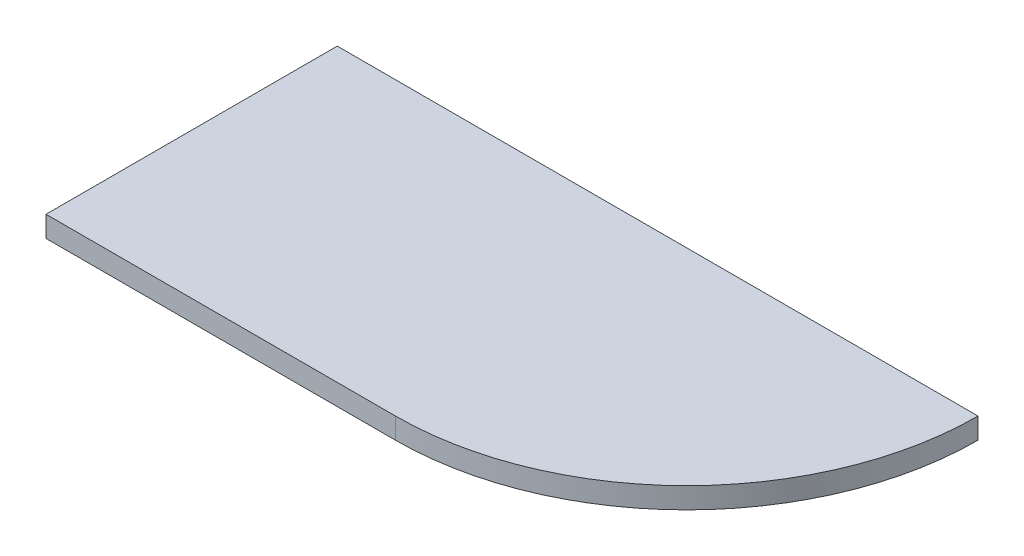
ISO-10303-21;
HEADER;
FILE_DESCRIPTION(('STEP AP214'),'2;1');
FILE_NAME('part.step','',(''),(''),'','','');
FILE_SCHEMA(('AUTOMOTIVE_DESIGN { 1 0 10303 214 1 1 1 1 }'));
ENDSEC;
DATA;
#1=APPLICATION_CONTEXT('core data for automotive mechanical design processes');
#2=APPLICATION_PROTOCOL_DEFINITION('international standard','automotive_design',2000,#1);
#3=PRODUCT_CONTEXT('',#1,'mechanical');
#4=PRODUCT('Part','Part','',(#3));
#5=PRODUCT_RELATED_PRODUCT_CATEGORY('part','',(#4));
#6=PRODUCT_DEFINITION_FORMATION('','',#4);
#7=PRODUCT_DEFINITION_CONTEXT('part definition',#1,'design');
#8=PRODUCT_DEFINITION('design','',#6,#7);
#9=PRODUCT_DEFINITION_SHAPE('','',#8);
#10=(LENGTH_UNIT() NAMED_UNIT(*) SI_UNIT(.MILLI.,.METRE.));
#11=(NAMED_UNIT(*) PLANE_ANGLE_UNIT() SI_UNIT($,.RADIAN.));
#12=(NAMED_UNIT(*) SI_UNIT($,.STERADIAN.) SOLID_ANGLE_UNIT());
#13=UNCERTAINTY_MEASURE_WITH_UNIT(LENGTH_MEASURE(1.E-05),#10,'distance_accuracy_value','');
#14=(GEOMETRIC_REPRESENTATION_CONTEXT(3) GLOBAL_UNCERTAINTY_ASSIGNED_CONTEXT((#13)) GLOBAL_UNIT_ASSIGNED_CONTEXT((#10,
#11,#12)) REPRESENTATION_CONTEXT('',''));
#15=CARTESIAN_POINT('',(0.,0.,0.));
#16=DIRECTION('',(0.,0.,1.));
#17=DIRECTION('',(1.,0.,0.));
#18=AXIS2_PLACEMENT_3D('',#15,#16,#17);
#19=CARTESIAN_POINT('',(-275.,18.,125.));
#20=DIRECTION('',(1.,0.,0.));
#21=DIRECTION('',(0.,0.,-1.));
#22=AXIS2_PLACEMENT_3D('',#19,#20,#21);
#23=PLANE('',#22);
#24=DIRECTION('',(0.,0.,1.));
#25=VECTOR('',#24,1.);
#26=CARTESIAN_POINT('',(-275.,0.,125.));
#27=LINE('',#26,#25);
#28=CARTESIAN_POINT('',(-275.,0.,-125.));
#29=VERTEX_POINT('',#28);
#30=CARTESIAN_POINT('',(-275.,0.,125.));
#31=VERTEX_POINT('',#30);
#32=EDGE_CURVE('E107',#29,#31,#27,.T.);
#33=ORIENTED_EDGE('',*,*,#32,.T.);
#34=DIRECTION('',(0.,-1.,0.));
#35=VECTOR('',#34,1.);
#36=CARTESIAN_POINT('',(-275.,18.,125.));
#37=LINE('',#36,#35);
#38=CARTESIAN_POINT('',(-275.,18.,125.));
#39=VERTEX_POINT('',#38);
#40=EDGE_CURVE('E11',#39,#31,#37,.T.);
#41=ORIENTED_EDGE('',*,*,#40,.F.);
#42=DIRECTION('',(0.,0.,1.));
#43=VECTOR('',#42,1.);
#44=CARTESIAN_POINT('',(-275.,18.,125.));
#45=LINE('',#44,#43);
#46=CARTESIAN_POINT('',(-275.,18.,-125.));
#47=VERTEX_POINT('',#46);
#48=EDGE_CURVE('E115',#47,#39,#45,.T.);
#49=ORIENTED_EDGE('',*,*,#48,.F.);
#50=DIRECTION('',(0.,-1.,0.));
#51=VECTOR('',#50,1.);
#52=CARTESIAN_POINT('',(-275.,18.,-125.));
#53=LINE('',#52,#51);
#54=EDGE_CURVE('E103',#47,#29,#53,.T.);
#55=ORIENTED_EDGE('',*,*,#54,.T.);
#56=EDGE_LOOP('',(#33,#41,#49,#55));
#57=FACE_BOUND('',#56,.T.);
#58=ADVANCED_FACE('F33',(#57),#23,.F.);
#59=CARTESIAN_POINT('',(25.0009999999982,18.,125.));
#60=DIRECTION('',(0.,0.,-1.));
#61=DIRECTION('',(-1.,0.,0.));
#62=AXIS2_PLACEMENT_3D('',#59,#60,#61);
#63=PLANE('',#62);
#64=DIRECTION('',(1.,0.,0.));
#65=VECTOR('',#64,1.);
#66=CARTESIAN_POINT('',(25.0009999999982,0.,125.));
#67=LINE('',#66,#65);
#68=CARTESIAN_POINT('',(25.0009999999983,0.,125.));
#69=VERTEX_POINT('',#68);
#70=EDGE_CURVE('E110',#31,#69,#67,.T.);
#71=ORIENTED_EDGE('',*,*,#70,.T.);
#72=DIRECTION('',(0.,-1.,0.));
#73=VECTOR('',#72,1.);
#74=CARTESIAN_POINT('',(25.0009999999983,18.,125.));
#75=LINE('',#74,#73);
#76=CARTESIAN_POINT('',(25.0009999999983,18.,125.));
#77=VERTEX_POINT('',#76);
#78=EDGE_CURVE('E41',#77,#69,#75,.T.);
#79=ORIENTED_EDGE('',*,*,#78,.F.);
#80=DIRECTION('',(1.,0.,0.));
#81=VECTOR('',#80,1.);
#82=CARTESIAN_POINT('',(25.0009999999982,18.,125.));
#83=LINE('',#82,#81);
#84=EDGE_CURVE('E83',#39,#77,#83,.T.);
#85=ORIENTED_EDGE('',*,*,#84,.F.);
#86=ORIENTED_EDGE('',*,*,#40,.T.);
#87=EDGE_LOOP('',(#71,#79,#85,#86));
#88=FACE_BOUND('',#87,.T.);
#89=ADVANCED_FACE('F134',(#88),#63,.F.);
#90=CARTESIAN_POINT('',(25.001,18.,-124.999));
#91=DIRECTION('',(0.,-1.,0.));
#92=DIRECTION('',(0.,0.,-1.));
#93=AXIS2_PLACEMENT_3D('',#90,#91,#92);
#94=CYLINDRICAL_SURFACE('',#93,249.999);
#95=CARTESIAN_POINT('',(25.001,0.,-124.999));
#96=DIRECTION('',(0.,1.,0.));
#97=DIRECTION('',(0.,0.,-1.));
#98=AXIS2_PLACEMENT_3D('',#95,#96,#97);
#99=CIRCLE('',#98,249.999);
#100=CARTESIAN_POINT('',(275.,0.,-124.999000000002));
#101=VERTEX_POINT('',#100);
#102=EDGE_CURVE('E98',#69,#101,#99,.T.);
#103=ORIENTED_EDGE('',*,*,#102,.T.);
#104=DIRECTION('',(0.,-1.,0.));
#105=VECTOR('',#104,1.);
#106=CARTESIAN_POINT('',(275.,18.,-124.999000000002));
#107=LINE('',#106,#105);
#108=CARTESIAN_POINT('',(275.,18.,-124.999000000002));
#109=VERTEX_POINT('',#108);
#110=EDGE_CURVE('E95',#109,#101,#107,.T.);
#111=ORIENTED_EDGE('',*,*,#110,.F.);
#112=CARTESIAN_POINT('',(25.001,18.,-124.999));
#113=DIRECTION('',(0.,1.,0.));
#114=DIRECTION('',(0.,0.,-1.));
#115=AXIS2_PLACEMENT_3D('',#112,#113,#114);
#116=CIRCLE('',#115,249.999);
#117=EDGE_CURVE('E87',#77,#109,#116,.T.);
#118=ORIENTED_EDGE('',*,*,#117,.F.);
#119=ORIENTED_EDGE('',*,*,#78,.T.);
#120=EDGE_LOOP('',(#103,#111,#118,#119));
#121=FACE_BOUND('',#120,.T.);
#122=ADVANCED_FACE('F96',(#121),#94,.T.);
#123=CARTESIAN_POINT('',(275.,18.,-124.999000000002));
#124=DIRECTION('',(-1.,0.,0.));
#125=DIRECTION('',(0.,0.,1.));
#126=AXIS2_PLACEMENT_3D('',#123,#124,#125);
#127=PLANE('',#126);
#128=DIRECTION('',(0.,0.,-1.));
#129=VECTOR('',#128,1.);
#130=CARTESIAN_POINT('',(275.,0.,-124.999000000002));
#131=LINE('',#130,#129);
#132=CARTESIAN_POINT('',(275.,0.,-125.));
#133=VERTEX_POINT('',#132);
#134=EDGE_CURVE('E69',#101,#133,#131,.T.);
#135=ORIENTED_EDGE('',*,*,#134,.T.);
#136=DIRECTION('',(0.,-1.,0.));
#137=VECTOR('',#136,1.);
#138=CARTESIAN_POINT('',(275.,18.,-125.));
#139=LINE('',#138,#137);
#140=CARTESIAN_POINT('',(275.,18.,-125.));
#141=VERTEX_POINT('',#140);
#142=EDGE_CURVE('E99',#141,#133,#139,.T.);
#143=ORIENTED_EDGE('',*,*,#142,.F.);
#144=DIRECTION('',(0.,0.,-1.));
#145=VECTOR('',#144,1.);
#146=CARTESIAN_POINT('',(275.,18.,-124.999000000002));
#147=LINE('',#146,#145);
#148=EDGE_CURVE('E91',#109,#141,#147,.T.);
#149=ORIENTED_EDGE('',*,*,#148,.F.);
#150=ORIENTED_EDGE('',*,*,#110,.T.);
#151=EDGE_LOOP('',(#135,#143,#149,#150));
#152=FACE_BOUND('',#151,.T.);
#153=ADVANCED_FACE('F101',(#152),#127,.F.);
#154=CARTESIAN_POINT('',(275.,18.,-125.));
#155=DIRECTION('',(0.,0.,1.));
#156=DIRECTION('',(1.,0.,0.));
#157=AXIS2_PLACEMENT_3D('',#154,#155,#156);
#158=PLANE('',#157);
#159=DIRECTION('',(-1.,0.,0.));
#160=VECTOR('',#159,1.);
#161=CARTESIAN_POINT('',(275.,0.,-125.));
#162=LINE('',#161,#160);
#163=EDGE_CURVE('E75',#133,#29,#162,.T.);
#164=ORIENTED_EDGE('',*,*,#163,.T.);
#165=ORIENTED_EDGE('',*,*,#54,.F.);
#166=DIRECTION('',(-1.,0.,0.));
#167=VECTOR('',#166,1.);
#168=CARTESIAN_POINT('',(275.,18.,-125.));
#169=LINE('',#168,#167);
#170=EDGE_CURVE('E49',#141,#47,#169,.T.);
#171=ORIENTED_EDGE('',*,*,#170,.F.);
#172=ORIENTED_EDGE('',*,*,#142,.T.);
#173=EDGE_LOOP('',(#164,#165,#171,#172));
#174=FACE_BOUND('',#173,.T.);
#175=ADVANCED_FACE('F123',(#174),#158,.F.);
#176=CARTESIAN_POINT('',(25.001,18.,-124.999));
#177=DIRECTION('',(0.,-1.,0.));
#178=DIRECTION('',(0.,0.,-1.));
#179=AXIS2_PLACEMENT_3D('',#176,#177,#178);
#180=PLANE('',#179);
#181=ORIENTED_EDGE('',*,*,#48,.T.);
#182=ORIENTED_EDGE('',*,*,#84,.T.);
#183=ORIENTED_EDGE('',*,*,#117,.T.);
#184=ORIENTED_EDGE('',*,*,#148,.T.);
#185=ORIENTED_EDGE('',*,*,#170,.T.);
#186=EDGE_LOOP('',(#181,#182,#183,#184,#185));
#187=FACE_BOUND('',#186,.T.);
#188=ADVANCED_FACE('F89',(#187),#180,.F.);
#189=CARTESIAN_POINT('',(25.001,0.,-124.999));
#190=DIRECTION('',(0.,-1.,0.));
#191=DIRECTION('',(0.,0.,-1.));
#192=AXIS2_PLACEMENT_3D('',#189,#190,#191);
#193=PLANE('',#192);
#194=ORIENTED_EDGE('',*,*,#32,.F.);
#195=ORIENTED_EDGE('',*,*,#163,.F.);
#196=ORIENTED_EDGE('',*,*,#134,.F.);
#197=ORIENTED_EDGE('',*,*,#102,.F.);
#198=ORIENTED_EDGE('',*,*,#70,.F.);
#199=EDGE_LOOP('',(#194,#195,#196,#197,#198));
#200=FACE_BOUND('',#199,.T.);
#201=ADVANCED_FACE('F119',(#200),#193,.T.);
#202=CLOSED_SHELL('',(#58,#89,#122,#153,#175,#188,#201));
#203=MANIFOLD_SOLID_BREP('B2',#202);
#204=ADVANCED_BREP_SHAPE_REPRESENTATION('',(#18,#203),#14);
#205=SHAPE_DEFINITION_REPRESENTATION(#9,#204);
ENDSEC;
END-ISO-10303-21;
